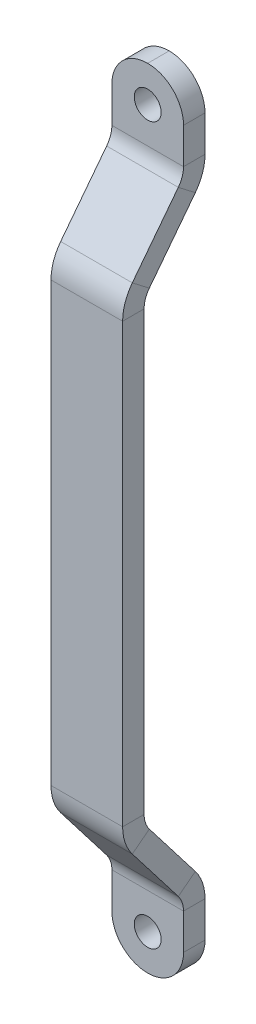
ISO-10303-21;
HEADER;
FILE_DESCRIPTION(('STEP AP214'),'2;1');
FILE_NAME('part.step','',(''),(''),'','','');
FILE_SCHEMA(('AUTOMOTIVE_DESIGN { 1 0 10303 214 1 1 1 1 }'));
ENDSEC;
DATA;
#1=APPLICATION_CONTEXT('core data for automotive mechanical design processes');
#2=APPLICATION_PROTOCOL_DEFINITION('international standard','automotive_design',2000,#1);
#3=PRODUCT_CONTEXT('',#1,'mechanical');
#4=PRODUCT('Part','Part','',(#3));
#5=PRODUCT_RELATED_PRODUCT_CATEGORY('part','',(#4));
#6=PRODUCT_DEFINITION_FORMATION('','',#4);
#7=PRODUCT_DEFINITION_CONTEXT('part definition',#1,'design');
#8=PRODUCT_DEFINITION('design','',#6,#7);
#9=PRODUCT_DEFINITION_SHAPE('','',#8);
#10=(LENGTH_UNIT() NAMED_UNIT(*) SI_UNIT(.MILLI.,.METRE.));
#11=(NAMED_UNIT(*) PLANE_ANGLE_UNIT() SI_UNIT($,.RADIAN.));
#12=(NAMED_UNIT(*) SI_UNIT($,.STERADIAN.) SOLID_ANGLE_UNIT());
#13=UNCERTAINTY_MEASURE_WITH_UNIT(LENGTH_MEASURE(1.E-05),#10,'distance_accuracy_value','');
#14=(GEOMETRIC_REPRESENTATION_CONTEXT(3) GLOBAL_UNCERTAINTY_ASSIGNED_CONTEXT((#13)) GLOBAL_UNIT_ASSIGNED_CONTEXT((#10,
#11,#12)) REPRESENTATION_CONTEXT('',''));
#15=CARTESIAN_POINT('',(0.,0.,0.));
#16=DIRECTION('',(0.,0.,1.));
#17=DIRECTION('',(1.,0.,0.));
#18=AXIS2_PLACEMENT_3D('',#15,#16,#17);
#19=CARTESIAN_POINT('',(0.,0.,0.));
#20=DIRECTION('',(-1.,0.,0.));
#21=DIRECTION('',(0.,0.,1.));
#22=AXIS2_PLACEMENT_3D('',#19,#20,#21);
#23=PLANE('',#22);
#24=DIRECTION('',(0.,1.,0.));
#25=VECTOR('',#24,1.);
#26=CARTESIAN_POINT('',(0.,0.,0.));
#27=LINE('',#26,#25);
#28=CARTESIAN_POINT('',(0.,5.,0.));
#29=VERTEX_POINT('',#28);
#30=CARTESIAN_POINT('',(0.,10.,0.));
#31=VERTEX_POINT('',#30);
#32=EDGE_CURVE('E302',#29,#31,#27,.T.);
#33=ORIENTED_EDGE('',*,*,#32,.F.);
#34=DIRECTION('',(0.,0.,1.));
#35=VECTOR('',#34,1.);
#36=CARTESIAN_POINT('',(0.,5.,3.));
#37=LINE('',#36,#35);
#38=CARTESIAN_POINT('',(0.,5.,3.));
#39=VERTEX_POINT('',#38);
#40=EDGE_CURVE('E414',#29,#39,#37,.T.);
#41=ORIENTED_EDGE('',*,*,#40,.T.);
#42=DIRECTION('',(0.,1.,0.));
#43=VECTOR('',#42,1.);
#44=CARTESIAN_POINT('',(0.,0.,3.));
#45=LINE('',#44,#43);
#46=CARTESIAN_POINT('',(0.,10.,3.));
#47=VERTEX_POINT('',#46);
#48=EDGE_CURVE('E306',#39,#47,#45,.T.);
#49=ORIENTED_EDGE('',*,*,#48,.T.);
#50=DIRECTION('',(0.,0.,1.));
#51=VECTOR('',#50,1.);
#52=CARTESIAN_POINT('',(0.,10.,0.));
#53=LINE('',#52,#51);
#54=EDGE_CURVE('E303',#31,#47,#53,.T.);
#55=ORIENTED_EDGE('',*,*,#54,.F.);
#56=EDGE_LOOP('',(#33,#41,#49,#55));
#57=FACE_BOUND('',#56,.T.);
#58=ADVANCED_FACE('F37',(#57),#23,.T.);
#59=CARTESIAN_POINT('',(0.,0.,3.));
#60=DIRECTION('',(0.,0.,1.));
#61=DIRECTION('',(1.,0.,0.));
#62=AXIS2_PLACEMENT_3D('',#59,#60,#61);
#63=PLANE('',#62);
#64=CARTESIAN_POINT('',(5.,5.,3.));
#65=DIRECTION('',(0.,0.,1.));
#66=DIRECTION('',(1.,0.,0.));
#67=AXIS2_PLACEMENT_3D('',#64,#65,#66);
#68=CIRCLE('',#67,1.875);
#69=CARTESIAN_POINT('',(6.875,5.,3.));
#70=VERTEX_POINT('',#69);
#71=EDGE_CURVE('E198',#70,#70,#68,.T.);
#72=ORIENTED_EDGE('',*,*,#71,.F.);
#73=EDGE_LOOP('',(#72));
#74=FACE_BOUND('',#73,.T.);
#75=ORIENTED_EDGE('',*,*,#48,.F.);
#76=CARTESIAN_POINT('',(5.,5.,3.));
#77=DIRECTION('',(0.,0.,1.));
#78=DIRECTION('',(1.,0.,0.));
#79=AXIS2_PLACEMENT_3D('',#76,#77,#78);
#80=CIRCLE('',#79,5.);
#81=CARTESIAN_POINT('',(5.,0.,3.));
#82=VERTEX_POINT('',#81);
#83=EDGE_CURVE('E419',#39,#82,#80,.T.);
#84=ORIENTED_EDGE('',*,*,#83,.T.);
#85=CARTESIAN_POINT('',(5.,5.,3.));
#86=DIRECTION('',(0.,0.,1.));
#87=DIRECTION('',(1.,0.,0.));
#88=AXIS2_PLACEMENT_3D('',#85,#86,#87);
#89=CIRCLE('',#88,5.);
#90=CARTESIAN_POINT('',(10.,5.,3.));
#91=VERTEX_POINT('',#90);
#92=EDGE_CURVE('E417',#82,#91,#89,.T.);
#93=ORIENTED_EDGE('',*,*,#92,.T.);
#94=DIRECTION('',(0.,1.,0.));
#95=VECTOR('',#94,1.);
#96=CARTESIAN_POINT('',(10.,0.,3.));
#97=LINE('',#96,#95);
#98=CARTESIAN_POINT('',(10.,10.,3.));
#99=VERTEX_POINT('',#98);
#100=EDGE_CURVE('E351',#91,#99,#97,.T.);
#101=ORIENTED_EDGE('',*,*,#100,.T.);
#102=DIRECTION('',(1.,0.,0.));
#103=VECTOR('',#102,1.);
#104=CARTESIAN_POINT('',(0.,10.,3.));
#105=LINE('',#104,#103);
#106=EDGE_CURVE('E308',#47,#99,#105,.T.);
#107=ORIENTED_EDGE('',*,*,#106,.F.);
#108=EDGE_LOOP('',(#75,#84,#93,#101,#107));
#109=FACE_BOUND('',#108,.T.);
#110=ADVANCED_FACE('F440',(#74,#109),#63,.T.);
#111=CARTESIAN_POINT('',(10.,0.,0.));
#112=DIRECTION('',(1.,0.,0.));
#113=DIRECTION('',(0.,0.,-1.));
#114=AXIS2_PLACEMENT_3D('',#111,#112,#113);
#115=PLANE('',#114);
#116=ORIENTED_EDGE('',*,*,#100,.F.);
#117=DIRECTION('',(0.,0.,-1.));
#118=VECTOR('',#117,1.);
#119=CARTESIAN_POINT('',(10.,5.,0.));
#120=LINE('',#119,#118);
#121=CARTESIAN_POINT('',(10.,5.,0.));
#122=VERTEX_POINT('',#121);
#123=EDGE_CURVE('E11',#91,#122,#120,.T.);
#124=ORIENTED_EDGE('',*,*,#123,.T.);
#125=DIRECTION('',(0.,1.,0.));
#126=VECTOR('',#125,1.);
#127=CARTESIAN_POINT('',(10.,0.,0.));
#128=LINE('',#127,#126);
#129=CARTESIAN_POINT('',(10.,10.,0.));
#130=VERTEX_POINT('',#129);
#131=EDGE_CURVE('E376',#122,#130,#128,.T.);
#132=ORIENTED_EDGE('',*,*,#131,.T.);
#133=DIRECTION('',(0.,0.,-1.));
#134=VECTOR('',#133,1.);
#135=CARTESIAN_POINT('',(10.,10.,0.));
#136=LINE('',#135,#134);
#137=EDGE_CURVE('E353',#99,#130,#136,.T.);
#138=ORIENTED_EDGE('',*,*,#137,.F.);
#139=EDGE_LOOP('',(#116,#124,#132,#138));
#140=FACE_BOUND('',#139,.T.);
#141=ADVANCED_FACE('F444',(#140),#115,.T.);
#142=CARTESIAN_POINT('',(0.,0.,0.));
#143=DIRECTION('',(0.,0.,-1.));
#144=DIRECTION('',(-1.,0.,0.));
#145=AXIS2_PLACEMENT_3D('',#142,#143,#144);
#146=PLANE('',#145);
#147=CARTESIAN_POINT('',(5.,5.,0.));
#148=DIRECTION('',(0.,0.,-1.));
#149=DIRECTION('',(-1.,0.,0.));
#150=AXIS2_PLACEMENT_3D('',#147,#148,#149);
#151=CIRCLE('',#150,1.875);
#152=CARTESIAN_POINT('',(3.125,5.,0.));
#153=VERTEX_POINT('',#152);
#154=EDGE_CURVE('E424',#153,#153,#151,.T.);
#155=ORIENTED_EDGE('',*,*,#154,.F.);
#156=EDGE_LOOP('',(#155));
#157=FACE_BOUND('',#156,.T.);
#158=CARTESIAN_POINT('',(5.,5.,0.));
#159=DIRECTION('',(0.,0.,-1.));
#160=DIRECTION('',(-1.,0.,0.));
#161=AXIS2_PLACEMENT_3D('',#158,#159,#160);
#162=CIRCLE('',#161,5.);
#163=CARTESIAN_POINT('',(5.,0.,0.));
#164=VERTEX_POINT('',#163);
#165=EDGE_CURVE('E54',#122,#164,#162,.T.);
#166=ORIENTED_EDGE('',*,*,#165,.T.);
#167=CARTESIAN_POINT('',(5.,5.,0.));
#168=DIRECTION('',(0.,0.,-1.));
#169=DIRECTION('',(-1.,0.,0.));
#170=AXIS2_PLACEMENT_3D('',#167,#168,#169);
#171=CIRCLE('',#170,5.);
#172=EDGE_CURVE('E46',#164,#29,#171,.T.);
#173=ORIENTED_EDGE('',*,*,#172,.T.);
#174=ORIENTED_EDGE('',*,*,#32,.T.);
#175=DIRECTION('',(-1.,0.,0.));
#176=VECTOR('',#175,1.);
#177=CARTESIAN_POINT('',(0.,10.,0.));
#178=LINE('',#177,#176);
#179=EDGE_CURVE('E320',#130,#31,#178,.T.);
#180=ORIENTED_EDGE('',*,*,#179,.F.);
#181=ORIENTED_EDGE('',*,*,#131,.F.);
#182=EDGE_LOOP('',(#166,#173,#174,#180,#181));
#183=FACE_BOUND('',#182,.T.);
#184=ADVANCED_FACE('F459',(#157,#183),#146,.T.);
#185=CARTESIAN_POINT('',(0.,10.,0.));
#186=DIRECTION('',(-1.,0.,0.));
#187=DIRECTION('',(0.,0.,1.));
#188=AXIS2_PLACEMENT_3D('',#185,#186,#187);
#189=PLANE('',#188);
#190=CARTESIAN_POINT('',(0.,10.,6.5));
#191=DIRECTION('',(1.,0.,0.));
#192=DIRECTION('',(0.,0.,-1.));
#193=AXIS2_PLACEMENT_3D('',#190,#191,#192);
#194=CIRCLE('',#193,3.5);
#195=CARTESIAN_POINT('',(0.,12.1361264202435,3.72746254908296));
#196=VERTEX_POINT('',#195);
#197=EDGE_CURVE('E313',#47,#196,#194,.T.);
#198=ORIENTED_EDGE('',*,*,#197,.T.);
#199=DIRECTION('',(0.,-0.610321834355294,0.792153557404869));
#200=VECTOR('',#199,1.);
#201=CARTESIAN_POINT('',(0.,13.9670919233094,1.35100187686835));
#202=LINE('',#201,#200);
#203=CARTESIAN_POINT('',(0.,13.9670919233094,1.35100187686835));
#204=VERTEX_POINT('',#203);
#205=EDGE_CURVE('E310',#204,#196,#202,.T.);
#206=ORIENTED_EDGE('',*,*,#205,.F.);
#207=CARTESIAN_POINT('',(0.,10.,6.5));
#208=DIRECTION('',(1.,0.,0.));
#209=DIRECTION('',(0.,0.,-1.));
#210=AXIS2_PLACEMENT_3D('',#207,#208,#209);
#211=CIRCLE('',#210,6.5);
#212=EDGE_CURVE('E314',#31,#204,#211,.T.);
#213=ORIENTED_EDGE('',*,*,#212,.F.);
#214=ORIENTED_EDGE('',*,*,#54,.T.);
#215=EDGE_LOOP('',(#198,#206,#213,#214));
#216=FACE_BOUND('',#215,.T.);
#217=ADVANCED_FACE('F454',(#216),#189,.T.);
#218=CARTESIAN_POINT('',(0.,10.,6.5));
#219=DIRECTION('',(1.,0.,0.));
#220=DIRECTION('',(0.,0.,-1.));
#221=AXIS2_PLACEMENT_3D('',#218,#219,#220);
#222=CYLINDRICAL_SURFACE('',#221,3.5);
#223=CARTESIAN_POINT('',(10.,10.,6.5));
#224=DIRECTION('',(1.,0.,0.));
#225=DIRECTION('',(0.,0.,-1.));
#226=AXIS2_PLACEMENT_3D('',#223,#224,#225);
#227=CIRCLE('',#226,3.5);
#228=CARTESIAN_POINT('',(10.,12.1361264202435,3.72746254908296));
#229=VERTEX_POINT('',#228);
#230=EDGE_CURVE('E356',#99,#229,#227,.T.);
#231=ORIENTED_EDGE('',*,*,#230,.T.);
#232=DIRECTION('',(1.,0.,0.));
#233=VECTOR('',#232,1.);
#234=CARTESIAN_POINT('',(0.,12.1361264202435,3.72746254908296));
#235=LINE('',#234,#233);
#236=EDGE_CURVE('E317',#196,#229,#235,.T.);
#237=ORIENTED_EDGE('',*,*,#236,.F.);
#238=ORIENTED_EDGE('',*,*,#197,.F.);
#239=ORIENTED_EDGE('',*,*,#106,.T.);
#240=EDGE_LOOP('',(#231,#237,#238,#239));
#241=FACE_BOUND('',#240,.T.);
#242=ADVANCED_FACE('F449',(#241),#222,.F.);
#243=CARTESIAN_POINT('',(10.,10.,0.));
#244=DIRECTION('',(1.,0.,0.));
#245=DIRECTION('',(0.,0.,-1.));
#246=AXIS2_PLACEMENT_3D('',#243,#244,#245);
#247=PLANE('',#246);
#248=CARTESIAN_POINT('',(10.,10.,6.5));
#249=DIRECTION('',(1.,0.,0.));
#250=DIRECTION('',(0.,0.,-1.));
#251=AXIS2_PLACEMENT_3D('',#248,#249,#250);
#252=CIRCLE('',#251,6.5);
#253=CARTESIAN_POINT('',(10.,13.9670919233094,1.35100187686835));
#254=VERTEX_POINT('',#253);
#255=EDGE_CURVE('E380',#130,#254,#252,.T.);
#256=ORIENTED_EDGE('',*,*,#255,.T.);
#257=DIRECTION('',(0.,0.610321834355294,-0.792153557404869));
#258=VECTOR('',#257,1.);
#259=CARTESIAN_POINT('',(10.,13.9670919233094,1.35100187686835));
#260=LINE('',#259,#258);
#261=EDGE_CURVE('E359',#229,#254,#260,.T.);
#262=ORIENTED_EDGE('',*,*,#261,.F.);
#263=ORIENTED_EDGE('',*,*,#230,.F.);
#264=ORIENTED_EDGE('',*,*,#137,.T.);
#265=EDGE_LOOP('',(#256,#262,#263,#264));
#266=FACE_BOUND('',#265,.T.);
#267=ADVANCED_FACE('F464',(#266),#247,.T.);
#268=CARTESIAN_POINT('',(0.,10.,6.5));
#269=DIRECTION('',(1.,0.,0.));
#270=DIRECTION('',(0.,0.,-1.));
#271=AXIS2_PLACEMENT_3D('',#268,#269,#270);
#272=CYLINDRICAL_SURFACE('',#271,6.5);
#273=DIRECTION('',(-1.,0.,0.));
#274=VECTOR('',#273,1.);
#275=CARTESIAN_POINT('',(0.,13.9670919233094,1.35100187686835));
#276=LINE('',#275,#274);
#277=EDGE_CURVE('E331',#254,#204,#276,.T.);
#278=ORIENTED_EDGE('',*,*,#277,.F.);
#279=ORIENTED_EDGE('',*,*,#255,.F.);
#280=ORIENTED_EDGE('',*,*,#179,.T.);
#281=ORIENTED_EDGE('',*,*,#212,.T.);
#282=EDGE_LOOP('',(#278,#279,#280,#281));
#283=FACE_BOUND('',#282,.T.);
#284=ADVANCED_FACE('F462',(#283),#272,.T.);
#285=CARTESIAN_POINT('',(0.,13.9670919233094,1.35100187686835));
#286=DIRECTION('',(-1.,0.,0.));
#287=DIRECTION('',(0.,0.,1.));
#288=AXIS2_PLACEMENT_3D('',#285,#286,#287);
#289=PLANE('',#288);
#290=DIRECTION('',(0.,0.792153557404869,0.610321834355294));
#291=VECTOR('',#290,1.);
#292=CARTESIAN_POINT('',(0.,12.1361264202435,3.72746254908296));
#293=LINE('',#292,#291);
#294=CARTESIAN_POINT('',(0.,20.4708147152445,10.1489981231317));
#295=VERTEX_POINT('',#294);
#296=EDGE_CURVE('E324',#196,#295,#293,.T.);
#297=ORIENTED_EDGE('',*,*,#296,.T.);
#298=DIRECTION('',(0.,-0.610321834355294,0.792153557404869));
#299=VECTOR('',#298,1.);
#300=CARTESIAN_POINT('',(0.,22.3017802183104,7.77253745091705));
#301=LINE('',#300,#299);
#302=CARTESIAN_POINT('',(0.,22.3017802183104,7.77253745091705));
#303=VERTEX_POINT('',#302);
#304=EDGE_CURVE('E321',#303,#295,#301,.T.);
#305=ORIENTED_EDGE('',*,*,#304,.F.);
#306=DIRECTION('',(0.,0.792153557404869,0.610321834355294));
#307=VECTOR('',#306,1.);
#308=CARTESIAN_POINT('',(0.,13.9670919233094,1.35100187686835));
#309=LINE('',#308,#307);
#310=EDGE_CURVE('E325',#204,#303,#309,.T.);
#311=ORIENTED_EDGE('',*,*,#310,.F.);
#312=ORIENTED_EDGE('',*,*,#205,.T.);
#313=EDGE_LOOP('',(#297,#305,#311,#312));
#314=FACE_BOUND('',#313,.T.);
#315=ADVANCED_FACE('F549',(#314),#289,.T.);
#316=CARTESIAN_POINT('',(0.,12.1361264202435,3.72746254908296));
#317=DIRECTION('',(0.,-0.610321834355294,0.792153557404869));
#318=DIRECTION('',(0.,-0.792153557404869,-0.610321834355294));
#319=AXIS2_PLACEMENT_3D('',#316,#317,#318);
#320=PLANE('',#319);
#321=DIRECTION('',(0.,0.792153557404869,0.610321834355294));
#322=VECTOR('',#321,1.);
#323=CARTESIAN_POINT('',(10.,12.1361264202435,3.72746254908296));
#324=LINE('',#323,#322);
#325=CARTESIAN_POINT('',(10.,20.4708147152445,10.1489981231317));
#326=VERTEX_POINT('',#325);
#327=EDGE_CURVE('E362',#229,#326,#324,.T.);
#328=ORIENTED_EDGE('',*,*,#327,.T.);
#329=DIRECTION('',(1.,0.,0.));
#330=VECTOR('',#329,1.);
#331=CARTESIAN_POINT('',(0.,20.4708147152445,10.1489981231317));
#332=LINE('',#331,#330);
#333=EDGE_CURVE('E328',#295,#326,#332,.T.);
#334=ORIENTED_EDGE('',*,*,#333,.F.);
#335=ORIENTED_EDGE('',*,*,#296,.F.);
#336=ORIENTED_EDGE('',*,*,#236,.T.);
#337=EDGE_LOOP('',(#328,#334,#335,#336));
#338=FACE_BOUND('',#337,.T.);
#339=ADVANCED_FACE('F470',(#338),#320,.T.);
#340=CARTESIAN_POINT('',(10.,13.9670919233094,1.35100187686835));
#341=DIRECTION('',(1.,0.,0.));
#342=DIRECTION('',(0.,0.,-1.));
#343=AXIS2_PLACEMENT_3D('',#340,#341,#342);
#344=PLANE('',#343);
#345=DIRECTION('',(0.,0.792153557404869,0.610321834355294));
#346=VECTOR('',#345,1.);
#347=CARTESIAN_POINT('',(10.,13.9670919233094,1.35100187686835));
#348=LINE('',#347,#346);
#349=CARTESIAN_POINT('',(10.,22.3017802183104,7.77253745091705));
#350=VERTEX_POINT('',#349);
#351=EDGE_CURVE('E385',#254,#350,#348,.T.);
#352=ORIENTED_EDGE('',*,*,#351,.T.);
#353=DIRECTION('',(0.,0.610321834355294,-0.792153557404869));
#354=VECTOR('',#353,1.);
#355=CARTESIAN_POINT('',(10.,22.3017802183104,7.77253745091705));
#356=LINE('',#355,#354);
#357=EDGE_CURVE('E365',#326,#350,#356,.T.);
#358=ORIENTED_EDGE('',*,*,#357,.F.);
#359=ORIENTED_EDGE('',*,*,#327,.F.);
#360=ORIENTED_EDGE('',*,*,#261,.T.);
#361=EDGE_LOOP('',(#352,#358,#359,#360));
#362=FACE_BOUND('',#361,.T.);
#363=ADVANCED_FACE('F466',(#362),#344,.T.);
#364=CARTESIAN_POINT('',(0.,13.9670919233094,1.35100187686835));
#365=DIRECTION('',(0.,0.610321834355294,-0.792153557404869));
#366=DIRECTION('',(0.,0.792153557404869,0.610321834355294));
#367=AXIS2_PLACEMENT_3D('',#364,#365,#366);
#368=PLANE('',#367);
#369=DIRECTION('',(-1.,0.,0.));
#370=VECTOR('',#369,1.);
#371=CARTESIAN_POINT('',(0.,22.3017802183104,7.77253745091705));
#372=LINE('',#371,#370);
#373=EDGE_CURVE('E342',#350,#303,#372,.T.);
#374=ORIENTED_EDGE('',*,*,#373,.F.);
#375=ORIENTED_EDGE('',*,*,#351,.F.);
#376=ORIENTED_EDGE('',*,*,#277,.T.);
#377=ORIENTED_EDGE('',*,*,#310,.T.);
#378=EDGE_LOOP('',(#374,#375,#376,#377));
#379=FACE_BOUND('',#378,.T.);
#380=ADVANCED_FACE('F543',(#379),#368,.T.);
#381=CARTESIAN_POINT('',(0.,22.3017802183104,7.77253745091705));
#382=DIRECTION('',(-1.,0.,0.));
#383=DIRECTION('',(0.,0.,1.));
#384=AXIS2_PLACEMENT_3D('',#381,#382,#383);
#385=PLANE('',#384);
#386=CARTESIAN_POINT('',(0.,24.4379066385539,5.));
#387=DIRECTION('',(-1.,0.,0.));
#388=DIRECTION('',(0.,-0.610321834355294,0.792153557404869));
#389=AXIS2_PLACEMENT_3D('',#386,#387,#388);
#390=CIRCLE('',#389,6.5);
#391=CARTESIAN_POINT('',(0.,24.4379066385539,11.5));
#392=VERTEX_POINT('',#391);
#393=EDGE_CURVE('E335',#295,#392,#390,.T.);
#394=ORIENTED_EDGE('',*,*,#393,.T.);
#395=DIRECTION('',(0.,0.,1.));
#396=VECTOR('',#395,1.);
#397=CARTESIAN_POINT('',(0.,24.4379066385539,8.5));
#398=LINE('',#397,#396);
#399=CARTESIAN_POINT('',(0.,24.4379066385539,8.5));
#400=VERTEX_POINT('',#399);
#401=EDGE_CURVE('E332',#400,#392,#398,.T.);
#402=ORIENTED_EDGE('',*,*,#401,.F.);
#403=CARTESIAN_POINT('',(0.,24.4379066385539,5.));
#404=DIRECTION('',(-1.,0.,0.));
#405=DIRECTION('',(0.,-0.610321834355294,0.792153557404869));
#406=AXIS2_PLACEMENT_3D('',#403,#404,#405);
#407=CIRCLE('',#406,3.5);
#408=EDGE_CURVE('E336',#303,#400,#407,.T.);
#409=ORIENTED_EDGE('',*,*,#408,.F.);
#410=ORIENTED_EDGE('',*,*,#304,.T.);
#411=EDGE_LOOP('',(#394,#402,#409,#410));
#412=FACE_BOUND('',#411,.T.);
#413=ADVANCED_FACE('F476',(#412),#385,.T.);
#414=CARTESIAN_POINT('',(0.,24.4379066385539,5.));
#415=DIRECTION('',(-1.,0.,0.));
#416=DIRECTION('',(0.,0.,1.));
#417=AXIS2_PLACEMENT_3D('',#414,#415,#416);
#418=CYLINDRICAL_SURFACE('',#417,6.5);
#419=CARTESIAN_POINT('',(10.,24.4379066385539,5.));
#420=DIRECTION('',(-1.,0.,0.));
#421=DIRECTION('',(0.,-0.610321834355294,0.792153557404869));
#422=AXIS2_PLACEMENT_3D('',#419,#420,#421);
#423=CIRCLE('',#422,6.5);
#424=CARTESIAN_POINT('',(10.,24.4379066385539,11.5));
#425=VERTEX_POINT('',#424);
#426=EDGE_CURVE('E368',#326,#425,#423,.T.);
#427=ORIENTED_EDGE('',*,*,#426,.T.);
#428=DIRECTION('',(1.,0.,0.));
#429=VECTOR('',#428,1.);
#430=CARTESIAN_POINT('',(0.,24.4379066385539,11.5));
#431=LINE('',#430,#429);
#432=EDGE_CURVE('E339',#392,#425,#431,.T.);
#433=ORIENTED_EDGE('',*,*,#432,.F.);
#434=ORIENTED_EDGE('',*,*,#393,.F.);
#435=ORIENTED_EDGE('',*,*,#333,.T.);
#436=EDGE_LOOP('',(#427,#433,#434,#435));
#437=FACE_BOUND('',#436,.T.);
#438=ADVANCED_FACE('F472',(#437),#418,.T.);
#439=CARTESIAN_POINT('',(10.,22.3017802183104,7.77253745091705));
#440=DIRECTION('',(1.,0.,0.));
#441=DIRECTION('',(0.,0.,-1.));
#442=AXIS2_PLACEMENT_3D('',#439,#440,#441);
#443=PLANE('',#442);
#444=CARTESIAN_POINT('',(10.,24.4379066385539,5.));
#445=DIRECTION('',(-1.,0.,0.));
#446=DIRECTION('',(0.,-0.610321834355294,0.792153557404869));
#447=AXIS2_PLACEMENT_3D('',#444,#445,#446);
#448=CIRCLE('',#447,3.5);
#449=CARTESIAN_POINT('',(10.,24.4379066385539,8.5));
#450=VERTEX_POINT('',#449);
#451=EDGE_CURVE('E390',#350,#450,#448,.T.);
#452=ORIENTED_EDGE('',*,*,#451,.T.);
#453=DIRECTION('',(0.,0.,-1.));
#454=VECTOR('',#453,1.);
#455=CARTESIAN_POINT('',(10.,24.4379066385539,8.5));
#456=LINE('',#455,#454);
#457=EDGE_CURVE('E371',#425,#450,#456,.T.);
#458=ORIENTED_EDGE('',*,*,#457,.F.);
#459=ORIENTED_EDGE('',*,*,#426,.F.);
#460=ORIENTED_EDGE('',*,*,#357,.T.);
#461=EDGE_LOOP('',(#452,#458,#459,#460));
#462=FACE_BOUND('',#461,.T.);
#463=ADVANCED_FACE('F491',(#462),#443,.T.);
#464=CARTESIAN_POINT('',(0.,24.4379066385539,5.));
#465=DIRECTION('',(-1.,0.,0.));
#466=DIRECTION('',(0.,0.,1.));
#467=AXIS2_PLACEMENT_3D('',#464,#465,#466);
#468=CYLINDRICAL_SURFACE('',#467,3.5);
#469=DIRECTION('',(-1.,0.,0.));
#470=VECTOR('',#469,1.);
#471=CARTESIAN_POINT('',(0.,24.4379066385539,8.5));
#472=LINE('',#471,#470);
#473=EDGE_CURVE('E348',#450,#400,#472,.T.);
#474=ORIENTED_EDGE('',*,*,#473,.F.);
#475=ORIENTED_EDGE('',*,*,#451,.F.);
#476=ORIENTED_EDGE('',*,*,#373,.T.);
#477=ORIENTED_EDGE('',*,*,#408,.T.);
#478=EDGE_LOOP('',(#474,#475,#476,#477));
#479=FACE_BOUND('',#478,.T.);
#480=ADVANCED_FACE('F487',(#479),#468,.F.);
#481=CARTESIAN_POINT('',(0.,24.4379066385539,8.5));
#482=DIRECTION('',(-1.,0.,0.));
#483=DIRECTION('',(0.,0.,1.));
#484=AXIS2_PLACEMENT_3D('',#481,#482,#483);
#485=PLANE('',#484);
#486=DIRECTION('',(0.,1.,0.));
#487=VECTOR('',#486,1.);
#488=CARTESIAN_POINT('',(0.,24.4379066385539,11.5));
#489=LINE('',#488,#487);
#490=CARTESIAN_POINT('',(0.,85.5620933614461,11.5));
#491=VERTEX_POINT('',#490);
#492=EDGE_CURVE('E343',#392,#491,#489,.T.);
#493=ORIENTED_EDGE('',*,*,#492,.T.);
#494=DIRECTION('',(0.,0.,1.));
#495=VECTOR('',#494,1.);
#496=CARTESIAN_POINT('',(0.,85.5620933614461,8.5));
#497=LINE('',#496,#495);
#498=CARTESIAN_POINT('',(0.,85.5620933614461,8.5));
#499=VERTEX_POINT('',#498);
#500=EDGE_CURVE('E246',#499,#491,#497,.T.);
#501=ORIENTED_EDGE('',*,*,#500,.F.);
#502=DIRECTION('',(0.,1.,0.));
#503=VECTOR('',#502,1.);
#504=CARTESIAN_POINT('',(0.,24.4379066385539,8.5));
#505=LINE('',#504,#503);
#506=EDGE_CURVE('E346',#400,#499,#505,.T.);
#507=ORIENTED_EDGE('',*,*,#506,.F.);
#508=ORIENTED_EDGE('',*,*,#401,.T.);
#509=EDGE_LOOP('',(#493,#501,#507,#508));
#510=FACE_BOUND('',#509,.T.);
#511=ADVANCED_FACE('F479',(#510),#485,.T.);
#512=CARTESIAN_POINT('',(0.,24.4379066385539,11.5));
#513=DIRECTION('',(0.,0.,1.));
#514=DIRECTION('',(0.,-1.,0.));
#515=AXIS2_PLACEMENT_3D('',#512,#513,#514);
#516=PLANE('',#515);
#517=DIRECTION('',(0.,1.,0.));
#518=VECTOR('',#517,1.);
#519=CARTESIAN_POINT('',(10.,24.4379066385539,11.5));
#520=LINE('',#519,#518);
#521=CARTESIAN_POINT('',(10.,85.5620933614461,11.5));
#522=VERTEX_POINT('',#521);
#523=EDGE_CURVE('E345',#425,#522,#520,.T.);
#524=ORIENTED_EDGE('',*,*,#523,.T.);
#525=DIRECTION('',(1.,0.,0.));
#526=VECTOR('',#525,1.);
#527=CARTESIAN_POINT('',(0.,85.5620933614461,11.5));
#528=LINE('',#527,#526);
#529=EDGE_CURVE('E253',#491,#522,#528,.T.);
#530=ORIENTED_EDGE('',*,*,#529,.F.);
#531=ORIENTED_EDGE('',*,*,#492,.F.);
#532=ORIENTED_EDGE('',*,*,#432,.T.);
#533=EDGE_LOOP('',(#524,#530,#531,#532));
#534=FACE_BOUND('',#533,.T.);
#535=ADVANCED_FACE('F496',(#534),#516,.T.);
#536=CARTESIAN_POINT('',(10.,24.4379066385539,8.5));
#537=DIRECTION('',(1.,0.,0.));
#538=DIRECTION('',(0.,0.,-1.));
#539=AXIS2_PLACEMENT_3D('',#536,#537,#538);
#540=PLANE('',#539);
#541=DIRECTION('',(0.,1.,0.));
#542=VECTOR('',#541,1.);
#543=CARTESIAN_POINT('',(10.,24.4379066385539,8.5));
#544=LINE('',#543,#542);
#545=CARTESIAN_POINT('',(10.,85.5620933614461,8.5));
#546=VERTEX_POINT('',#545);
#547=EDGE_CURVE('E373',#450,#546,#544,.T.);
#548=ORIENTED_EDGE('',*,*,#547,.T.);
#549=DIRECTION('',(0.,0.,-1.));
#550=VECTOR('',#549,1.);
#551=CARTESIAN_POINT('',(10.,85.5620933614461,8.5));
#552=LINE('',#551,#550);
#553=EDGE_CURVE('E279',#522,#546,#552,.T.);
#554=ORIENTED_EDGE('',*,*,#553,.F.);
#555=ORIENTED_EDGE('',*,*,#523,.F.);
#556=ORIENTED_EDGE('',*,*,#457,.T.);
#557=EDGE_LOOP('',(#548,#554,#555,#556));
#558=FACE_BOUND('',#557,.T.);
#559=ADVANCED_FACE('F493',(#558),#540,.T.);
#560=CARTESIAN_POINT('',(0.,24.4379066385539,8.5));
#561=DIRECTION('',(0.,0.,-1.));
#562=DIRECTION('',(0.,1.,0.));
#563=AXIS2_PLACEMENT_3D('',#560,#561,#562);
#564=PLANE('',#563);
#565=ORIENTED_EDGE('',*,*,#506,.T.);
#566=DIRECTION('',(-1.,0.,0.));
#567=VECTOR('',#566,1.);
#568=CARTESIAN_POINT('',(0.,85.5620933614461,8.5));
#569=LINE('',#568,#567);
#570=EDGE_CURVE('E295',#546,#499,#569,.T.);
#571=ORIENTED_EDGE('',*,*,#570,.F.);
#572=ORIENTED_EDGE('',*,*,#547,.F.);
#573=ORIENTED_EDGE('',*,*,#473,.T.);
#574=EDGE_LOOP('',(#565,#571,#572,#573));
#575=FACE_BOUND('',#574,.T.);
#576=ADVANCED_FACE('F485',(#575),#564,.T.);
#577=CARTESIAN_POINT('',(0.,110.,0.));
#578=DIRECTION('',(-1.,0.,0.));
#579=DIRECTION('',(0.,0.,1.));
#580=AXIS2_PLACEMENT_3D('',#577,#578,#579);
#581=PLANE('',#580);
#582=DIRECTION('',(0.,-1.,0.));
#583=VECTOR('',#582,1.);
#584=CARTESIAN_POINT('',(0.,110.,3.));
#585=LINE('',#584,#583);
#586=CARTESIAN_POINT('',(0.,105.,3.));
#587=VERTEX_POINT('',#586);
#588=CARTESIAN_POINT('',(0.,100.,3.));
#589=VERTEX_POINT('',#588);
#590=EDGE_CURVE('E226',#587,#589,#585,.T.);
#591=ORIENTED_EDGE('',*,*,#590,.F.);
#592=DIRECTION('',(0.,0.,1.));
#593=VECTOR('',#592,1.);
#594=CARTESIAN_POINT('',(0.,105.,0.));
#595=LINE('',#594,#593);
#596=CARTESIAN_POINT('',(0.,105.,0.));
#597=VERTEX_POINT('',#596);
#598=EDGE_CURVE('E194',#587,#597,#595,.F.);
#599=ORIENTED_EDGE('',*,*,#598,.T.);
#600=DIRECTION('',(0.,-1.,0.));
#601=VECTOR('',#600,1.);
#602=CARTESIAN_POINT('',(0.,110.,0.));
#603=LINE('',#602,#601);
#604=CARTESIAN_POINT('',(0.,100.,0.));
#605=VERTEX_POINT('',#604);
#606=EDGE_CURVE('E187',#597,#605,#603,.T.);
#607=ORIENTED_EDGE('',*,*,#606,.T.);
#608=DIRECTION('',(0.,0.,1.));
#609=VECTOR('',#608,1.);
#610=CARTESIAN_POINT('',(0.,100.,0.));
#611=LINE('',#610,#609);
#612=EDGE_CURVE('E192',#605,#589,#611,.T.);
#613=ORIENTED_EDGE('',*,*,#612,.T.);
#614=EDGE_LOOP('',(#591,#599,#607,#613));
#615=FACE_BOUND('',#614,.T.);
#616=ADVANCED_FACE('F190',(#615),#581,.T.);
#617=CARTESIAN_POINT('',(0.,110.,3.));
#618=DIRECTION('',(0.,0.,1.));
#619=DIRECTION('',(1.,0.,0.));
#620=AXIS2_PLACEMENT_3D('',#617,#618,#619);
#621=PLANE('',#620);
#622=CARTESIAN_POINT('',(5.,105.,3.));
#623=DIRECTION('',(0.,0.,1.));
#624=DIRECTION('',(1.,0.,0.));
#625=AXIS2_PLACEMENT_3D('',#622,#623,#624);
#626=CIRCLE('',#625,1.875);
#627=CARTESIAN_POINT('',(6.875,105.,3.));
#628=VERTEX_POINT('',#627);
#629=EDGE_CURVE('E636',#628,#628,#626,.T.);
#630=ORIENTED_EDGE('',*,*,#629,.F.);
#631=EDGE_LOOP('',(#630));
#632=FACE_BOUND('',#631,.T.);
#633=DIRECTION('',(0.,-1.,0.));
#634=VECTOR('',#633,1.);
#635=CARTESIAN_POINT('',(10.,110.,3.));
#636=LINE('',#635,#634);
#637=CARTESIAN_POINT('',(10.,105.,3.));
#638=VERTEX_POINT('',#637);
#639=CARTESIAN_POINT('',(10.,100.,3.));
#640=VERTEX_POINT('',#639);
#641=EDGE_CURVE('E259',#638,#640,#636,.T.);
#642=ORIENTED_EDGE('',*,*,#641,.F.);
#643=CARTESIAN_POINT('',(5.,105.,3.));
#644=DIRECTION('',(0.,0.,1.));
#645=DIRECTION('',(1.,0.,0.));
#646=AXIS2_PLACEMENT_3D('',#643,#644,#645);
#647=CIRCLE('',#646,5.);
#648=CARTESIAN_POINT('',(5.,110.,3.));
#649=VERTEX_POINT('',#648);
#650=EDGE_CURVE('E411',#638,#649,#647,.T.);
#651=ORIENTED_EDGE('',*,*,#650,.T.);
#652=CARTESIAN_POINT('',(5.,105.,3.));
#653=DIRECTION('',(0.,0.,1.));
#654=DIRECTION('',(1.,0.,0.));
#655=AXIS2_PLACEMENT_3D('',#652,#653,#654);
#656=CIRCLE('',#655,5.);
#657=EDGE_CURVE('E409',#649,#587,#656,.T.);
#658=ORIENTED_EDGE('',*,*,#657,.T.);
#659=ORIENTED_EDGE('',*,*,#590,.T.);
#660=DIRECTION('',(1.,0.,0.));
#661=VECTOR('',#660,1.);
#662=CARTESIAN_POINT('',(0.,100.,3.));
#663=LINE('',#662,#661);
#664=EDGE_CURVE('E228',#589,#640,#663,.T.);
#665=ORIENTED_EDGE('',*,*,#664,.T.);
#666=EDGE_LOOP('',(#642,#651,#658,#659,#665));
#667=FACE_BOUND('',#666,.T.);
#668=ADVANCED_FACE('F516',(#632,#667),#621,.T.);
#669=CARTESIAN_POINT('',(10.,110.,0.));
#670=DIRECTION('',(1.,0.,0.));
#671=DIRECTION('',(0.,0.,-1.));
#672=AXIS2_PLACEMENT_3D('',#669,#670,#671);
#673=PLANE('',#672);
#674=DIRECTION('',(0.,-1.,0.));
#675=VECTOR('',#674,1.);
#676=CARTESIAN_POINT('',(10.,110.,0.));
#677=LINE('',#676,#675);
#678=CARTESIAN_POINT('',(10.,105.,0.));
#679=VERTEX_POINT('',#678);
#680=CARTESIAN_POINT('',(10.,100.,0.));
#681=VERTEX_POINT('',#680);
#682=EDGE_CURVE('E218',#679,#681,#677,.T.);
#683=ORIENTED_EDGE('',*,*,#682,.F.);
#684=DIRECTION('',(0.,0.,-1.));
#685=VECTOR('',#684,1.);
#686=CARTESIAN_POINT('',(10.,105.,3.));
#687=LINE('',#686,#685);
#688=EDGE_CURVE('E406',#679,#638,#687,.F.);
#689=ORIENTED_EDGE('',*,*,#688,.T.);
#690=ORIENTED_EDGE('',*,*,#641,.T.);
#691=DIRECTION('',(0.,0.,-1.));
#692=VECTOR('',#691,1.);
#693=CARTESIAN_POINT('',(10.,100.,0.));
#694=LINE('',#693,#692);
#695=EDGE_CURVE('E261',#640,#681,#694,.T.);
#696=ORIENTED_EDGE('',*,*,#695,.T.);
#697=EDGE_LOOP('',(#683,#689,#690,#696));
#698=FACE_BOUND('',#697,.T.);
#699=ADVANCED_FACE('F522',(#698),#673,.T.);
#700=CARTESIAN_POINT('',(0.,110.,0.));
#701=DIRECTION('',(0.,0.,-1.));
#702=DIRECTION('',(-1.,0.,0.));
#703=AXIS2_PLACEMENT_3D('',#700,#701,#702);
#704=PLANE('',#703);
#705=CARTESIAN_POINT('',(5.,105.,0.));
#706=DIRECTION('',(0.,0.,-1.));
#707=DIRECTION('',(-1.,0.,0.));
#708=AXIS2_PLACEMENT_3D('',#705,#706,#707);
#709=CIRCLE('',#708,1.875);
#710=CARTESIAN_POINT('',(3.125,105.,0.));
#711=VERTEX_POINT('',#710);
#712=EDGE_CURVE('E429',#711,#711,#709,.T.);
#713=ORIENTED_EDGE('',*,*,#712,.F.);
#714=EDGE_LOOP('',(#713));
#715=FACE_BOUND('',#714,.T.);
#716=CARTESIAN_POINT('',(5.,105.,0.));
#717=DIRECTION('',(0.,0.,-1.));
#718=DIRECTION('',(-1.,0.,0.));
#719=AXIS2_PLACEMENT_3D('',#716,#717,#718);
#720=CIRCLE('',#719,5.);
#721=CARTESIAN_POINT('',(5.,110.,0.));
#722=VERTEX_POINT('',#721);
#723=EDGE_CURVE('E394',#597,#722,#720,.T.);
#724=ORIENTED_EDGE('',*,*,#723,.T.);
#725=CARTESIAN_POINT('',(5.,105.,0.));
#726=DIRECTION('',(0.,0.,-1.));
#727=DIRECTION('',(-1.,0.,0.));
#728=AXIS2_PLACEMENT_3D('',#725,#726,#727);
#729=CIRCLE('',#728,5.);
#730=EDGE_CURVE('E404',#722,#679,#729,.T.);
#731=ORIENTED_EDGE('',*,*,#730,.T.);
#732=ORIENTED_EDGE('',*,*,#682,.T.);
#733=DIRECTION('',(-1.,0.,0.));
#734=VECTOR('',#733,1.);
#735=CARTESIAN_POINT('',(0.,100.,0.));
#736=LINE('',#735,#734);
#737=EDGE_CURVE('E207',#681,#605,#736,.T.);
#738=ORIENTED_EDGE('',*,*,#737,.T.);
#739=ORIENTED_EDGE('',*,*,#606,.F.);
#740=EDGE_LOOP('',(#724,#731,#732,#738,#739));
#741=FACE_BOUND('',#740,.T.);
#742=ADVANCED_FACE('F216',(#715,#741),#704,.T.);
#743=CARTESIAN_POINT('',(0.,100.,0.));
#744=DIRECTION('',(-1.,0.,0.));
#745=DIRECTION('',(0.,0.,1.));
#746=AXIS2_PLACEMENT_3D('',#743,#744,#745);
#747=PLANE('',#746);
#748=CARTESIAN_POINT('',(0.,100.,6.5));
#749=DIRECTION('',(-1.,0.,0.));
#750=DIRECTION('',(0.,0.,-1.));
#751=AXIS2_PLACEMENT_3D('',#748,#749,#750);
#752=CIRCLE('',#751,3.5);
#753=CARTESIAN_POINT('',(0.,97.8638735797565,3.72746254908296));
#754=VERTEX_POINT('',#753);
#755=EDGE_CURVE('E224',#589,#754,#752,.T.);
#756=ORIENTED_EDGE('',*,*,#755,.F.);
#757=ORIENTED_EDGE('',*,*,#612,.F.);
#758=CARTESIAN_POINT('',(0.,100.,6.5));
#759=DIRECTION('',(-1.,0.,0.));
#760=DIRECTION('',(0.,0.,-1.));
#761=AXIS2_PLACEMENT_3D('',#758,#759,#760);
#762=CIRCLE('',#761,6.5);
#763=CARTESIAN_POINT('',(0.,96.0329080766906,1.35100187686835));
#764=VERTEX_POINT('',#763);
#765=EDGE_CURVE('E204',#605,#764,#762,.T.);
#766=ORIENTED_EDGE('',*,*,#765,.T.);
#767=DIRECTION('',(0.,0.610321834355294,0.792153557404869));
#768=VECTOR('',#767,1.);
#769=CARTESIAN_POINT('',(0.,96.0329080766906,1.35100187686835));
#770=LINE('',#769,#768);
#771=EDGE_CURVE('E214',#764,#754,#770,.T.);
#772=ORIENTED_EDGE('',*,*,#771,.T.);
#773=EDGE_LOOP('',(#756,#757,#766,#772));
#774=FACE_BOUND('',#773,.T.);
#775=ADVANCED_FACE('F222',(#774),#747,.T.);
#776=CARTESIAN_POINT('',(0.,100.,6.5));
#777=DIRECTION('',(1.,0.,0.));
#778=DIRECTION('',(0.,0.,-1.));
#779=AXIS2_PLACEMENT_3D('',#776,#777,#778);
#780=CYLINDRICAL_SURFACE('',#779,3.5);
#781=CARTESIAN_POINT('',(10.,100.,6.5));
#782=DIRECTION('',(-1.,0.,0.));
#783=DIRECTION('',(0.,0.,-1.));
#784=AXIS2_PLACEMENT_3D('',#781,#782,#783);
#785=CIRCLE('',#784,3.5);
#786=CARTESIAN_POINT('',(10.,97.8638735797565,3.72746254908296));
#787=VERTEX_POINT('',#786);
#788=EDGE_CURVE('E264',#640,#787,#785,.T.);
#789=ORIENTED_EDGE('',*,*,#788,.F.);
#790=ORIENTED_EDGE('',*,*,#664,.F.);
#791=ORIENTED_EDGE('',*,*,#755,.T.);
#792=DIRECTION('',(1.,0.,0.));
#793=VECTOR('',#792,1.);
#794=CARTESIAN_POINT('',(0.,97.8638735797565,3.72746254908296));
#795=LINE('',#794,#793);
#796=EDGE_CURVE('E234',#754,#787,#795,.T.);
#797=ORIENTED_EDGE('',*,*,#796,.T.);
#798=EDGE_LOOP('',(#789,#790,#791,#797));
#799=FACE_BOUND('',#798,.T.);
#800=ADVANCED_FACE('F512',(#799),#780,.F.);
#801=CARTESIAN_POINT('',(10.,100.,0.));
#802=DIRECTION('',(1.,0.,0.));
#803=DIRECTION('',(0.,0.,-1.));
#804=AXIS2_PLACEMENT_3D('',#801,#802,#803);
#805=PLANE('',#804);
#806=CARTESIAN_POINT('',(10.,100.,6.5));
#807=DIRECTION('',(-1.,0.,0.));
#808=DIRECTION('',(0.,0.,-1.));
#809=AXIS2_PLACEMENT_3D('',#806,#807,#808);
#810=CIRCLE('',#809,6.5);
#811=CARTESIAN_POINT('',(10.,96.0329080766906,1.35100187686835));
#812=VERTEX_POINT('',#811);
#813=EDGE_CURVE('E284',#681,#812,#810,.T.);
#814=ORIENTED_EDGE('',*,*,#813,.F.);
#815=ORIENTED_EDGE('',*,*,#695,.F.);
#816=ORIENTED_EDGE('',*,*,#788,.T.);
#817=DIRECTION('',(0.,-0.610321834355294,-0.792153557404869));
#818=VECTOR('',#817,1.);
#819=CARTESIAN_POINT('',(10.,96.0329080766906,1.35100187686835));
#820=LINE('',#819,#818);
#821=EDGE_CURVE('E267',#787,#812,#820,.T.);
#822=ORIENTED_EDGE('',*,*,#821,.T.);
#823=EDGE_LOOP('',(#814,#815,#816,#822));
#824=FACE_BOUND('',#823,.T.);
#825=ADVANCED_FACE('F596',(#824),#805,.T.);
#826=CARTESIAN_POINT('',(0.,100.,6.5));
#827=DIRECTION('',(1.,0.,0.));
#828=DIRECTION('',(0.,0.,-1.));
#829=AXIS2_PLACEMENT_3D('',#826,#827,#828);
#830=CYLINDRICAL_SURFACE('',#829,6.5);
#831=DIRECTION('',(-1.,0.,0.));
#832=VECTOR('',#831,1.);
#833=CARTESIAN_POINT('',(0.,96.0329080766906,1.35100187686835));
#834=LINE('',#833,#832);
#835=EDGE_CURVE('E210',#812,#764,#834,.T.);
#836=ORIENTED_EDGE('',*,*,#835,.T.);
#837=ORIENTED_EDGE('',*,*,#765,.F.);
#838=ORIENTED_EDGE('',*,*,#737,.F.);
#839=ORIENTED_EDGE('',*,*,#813,.T.);
#840=EDGE_LOOP('',(#836,#837,#838,#839));
#841=FACE_BOUND('',#840,.T.);
#842=ADVANCED_FACE('F205',(#841),#830,.T.);
#843=CARTESIAN_POINT('',(0.,96.0329080766906,1.35100187686835));
#844=DIRECTION('',(-1.,0.,0.));
#845=DIRECTION('',(0.,0.,1.));
#846=AXIS2_PLACEMENT_3D('',#843,#844,#845);
#847=PLANE('',#846);
#848=DIRECTION('',(0.,-0.792153557404869,0.610321834355294));
#849=VECTOR('',#848,1.);
#850=CARTESIAN_POINT('',(0.,97.8638735797565,3.72746254908296));
#851=LINE('',#850,#849);
#852=CARTESIAN_POINT('',(0.,89.5291852847555,10.1489981231317));
#853=VERTEX_POINT('',#852);
#854=EDGE_CURVE('E239',#754,#853,#851,.T.);
#855=ORIENTED_EDGE('',*,*,#854,.F.);
#856=ORIENTED_EDGE('',*,*,#771,.F.);
#857=DIRECTION('',(0.,-0.792153557404869,0.610321834355294));
#858=VECTOR('',#857,1.);
#859=CARTESIAN_POINT('',(0.,96.0329080766906,1.35100187686835));
#860=LINE('',#859,#858);
#861=CARTESIAN_POINT('',(0.,87.6982197816896,7.77253745091705));
#862=VERTEX_POINT('',#861);
#863=EDGE_CURVE('E240',#764,#862,#860,.T.);
#864=ORIENTED_EDGE('',*,*,#863,.T.);
#865=DIRECTION('',(0.,0.610321834355294,0.792153557404869));
#866=VECTOR('',#865,1.);
#867=CARTESIAN_POINT('',(0.,87.6982197816896,7.77253745091705));
#868=LINE('',#867,#866);
#869=EDGE_CURVE('E236',#862,#853,#868,.T.);
#870=ORIENTED_EDGE('',*,*,#869,.T.);
#871=EDGE_LOOP('',(#855,#856,#864,#870));
#872=FACE_BOUND('',#871,.T.);
#873=ADVANCED_FACE('F506',(#872),#847,.T.);
#874=CARTESIAN_POINT('',(0.,97.8638735797565,3.72746254908296));
#875=DIRECTION('',(0.,0.610321834355294,0.792153557404869));
#876=DIRECTION('',(0.,0.792153557404869,-0.610321834355294));
#877=AXIS2_PLACEMENT_3D('',#874,#875,#876);
#878=PLANE('',#877);
#879=DIRECTION('',(0.,-0.792153557404869,0.610321834355294));
#880=VECTOR('',#879,1.);
#881=CARTESIAN_POINT('',(10.,97.8638735797565,3.72746254908296));
#882=LINE('',#881,#880);
#883=CARTESIAN_POINT('',(10.,89.5291852847555,10.1489981231317));
#884=VERTEX_POINT('',#883);
#885=EDGE_CURVE('E270',#787,#884,#882,.T.);
#886=ORIENTED_EDGE('',*,*,#885,.F.);
#887=ORIENTED_EDGE('',*,*,#796,.F.);
#888=ORIENTED_EDGE('',*,*,#854,.T.);
#889=DIRECTION('',(1.,0.,0.));
#890=VECTOR('',#889,1.);
#891=CARTESIAN_POINT('',(0.,89.5291852847555,10.1489981231317));
#892=LINE('',#891,#890);
#893=EDGE_CURVE('E243',#853,#884,#892,.T.);
#894=ORIENTED_EDGE('',*,*,#893,.T.);
#895=EDGE_LOOP('',(#886,#887,#888,#894));
#896=FACE_BOUND('',#895,.T.);
#897=ADVANCED_FACE('F508',(#896),#878,.T.);
#898=CARTESIAN_POINT('',(10.,96.0329080766906,1.35100187686835));
#899=DIRECTION('',(1.,0.,0.));
#900=DIRECTION('',(0.,0.,-1.));
#901=AXIS2_PLACEMENT_3D('',#898,#899,#900);
#902=PLANE('',#901);
#903=DIRECTION('',(0.,-0.792153557404869,0.610321834355294));
#904=VECTOR('',#903,1.);
#905=CARTESIAN_POINT('',(10.,96.0329080766906,1.35100187686835));
#906=LINE('',#905,#904);
#907=CARTESIAN_POINT('',(10.,87.6982197816896,7.77253745091705));
#908=VERTEX_POINT('',#907);
#909=EDGE_CURVE('E288',#812,#908,#906,.T.);
#910=ORIENTED_EDGE('',*,*,#909,.F.);
#911=ORIENTED_EDGE('',*,*,#821,.F.);
#912=ORIENTED_EDGE('',*,*,#885,.T.);
#913=DIRECTION('',(0.,-0.610321834355294,-0.792153557404869));
#914=VECTOR('',#913,1.);
#915=CARTESIAN_POINT('',(10.,87.6982197816896,7.77253745091705));
#916=LINE('',#915,#914);
#917=EDGE_CURVE('E273',#884,#908,#916,.T.);
#918=ORIENTED_EDGE('',*,*,#917,.T.);
#919=EDGE_LOOP('',(#910,#911,#912,#918));
#920=FACE_BOUND('',#919,.T.);
#921=ADVANCED_FACE('F592',(#920),#902,.T.);
#922=CARTESIAN_POINT('',(0.,96.0329080766906,1.35100187686835));
#923=DIRECTION('',(0.,-0.610321834355294,-0.792153557404869));
#924=DIRECTION('',(0.,-0.792153557404869,0.610321834355294));
#925=AXIS2_PLACEMENT_3D('',#922,#923,#924);
#926=PLANE('',#925);
#927=DIRECTION('',(-1.,0.,0.));
#928=VECTOR('',#927,1.);
#929=CARTESIAN_POINT('',(0.,87.6982197816896,7.77253745091705));
#930=LINE('',#929,#928);
#931=EDGE_CURVE('E256',#908,#862,#930,.T.);
#932=ORIENTED_EDGE('',*,*,#931,.T.);
#933=ORIENTED_EDGE('',*,*,#863,.F.);
#934=ORIENTED_EDGE('',*,*,#835,.F.);
#935=ORIENTED_EDGE('',*,*,#909,.T.);
#936=EDGE_LOOP('',(#932,#933,#934,#935));
#937=FACE_BOUND('',#936,.T.);
#938=ADVANCED_FACE('F589',(#937),#926,.T.);
#939=CARTESIAN_POINT('',(0.,87.6982197816896,7.77253745091705));
#940=DIRECTION('',(-1.,0.,0.));
#941=DIRECTION('',(0.,0.,1.));
#942=AXIS2_PLACEMENT_3D('',#939,#940,#941);
#943=PLANE('',#942);
#944=CARTESIAN_POINT('',(0.,85.5620933614461,5.));
#945=DIRECTION('',(1.,0.,0.));
#946=DIRECTION('',(0.,0.610321834355294,0.792153557404869));
#947=AXIS2_PLACEMENT_3D('',#944,#945,#946);
#948=CIRCLE('',#947,6.5);
#949=EDGE_CURVE('E249',#853,#491,#948,.T.);
#950=ORIENTED_EDGE('',*,*,#949,.F.);
#951=ORIENTED_EDGE('',*,*,#869,.F.);
#952=CARTESIAN_POINT('',(0.,85.5620933614461,5.));
#953=DIRECTION('',(1.,0.,0.));
#954=DIRECTION('',(0.,0.610321834355294,0.792153557404869));
#955=AXIS2_PLACEMENT_3D('',#952,#953,#954);
#956=CIRCLE('',#955,3.5);
#957=EDGE_CURVE('E250',#862,#499,#956,.T.);
#958=ORIENTED_EDGE('',*,*,#957,.T.);
#959=ORIENTED_EDGE('',*,*,#500,.T.);
#960=EDGE_LOOP('',(#950,#951,#958,#959));
#961=FACE_BOUND('',#960,.T.);
#962=ADVANCED_FACE('F499',(#961),#943,.T.);
#963=CARTESIAN_POINT('',(0.,85.5620933614461,5.));
#964=DIRECTION('',(-1.,0.,0.));
#965=DIRECTION('',(0.,0.,1.));
#966=AXIS2_PLACEMENT_3D('',#963,#964,#965);
#967=CYLINDRICAL_SURFACE('',#966,6.5);
#968=CARTESIAN_POINT('',(10.,85.5620933614461,5.));
#969=DIRECTION('',(1.,0.,0.));
#970=DIRECTION('',(0.,0.610321834355294,0.792153557404869));
#971=AXIS2_PLACEMENT_3D('',#968,#969,#970);
#972=CIRCLE('',#971,6.5);
#973=EDGE_CURVE('E276',#884,#522,#972,.T.);
#974=ORIENTED_EDGE('',*,*,#973,.F.);
#975=ORIENTED_EDGE('',*,*,#893,.F.);
#976=ORIENTED_EDGE('',*,*,#949,.T.);
#977=ORIENTED_EDGE('',*,*,#529,.T.);
#978=EDGE_LOOP('',(#974,#975,#976,#977));
#979=FACE_BOUND('',#978,.T.);
#980=ADVANCED_FACE('F502',(#979),#967,.T.);
#981=CARTESIAN_POINT('',(10.,87.6982197816896,7.77253745091705));
#982=DIRECTION('',(1.,0.,0.));
#983=DIRECTION('',(0.,0.,-1.));
#984=AXIS2_PLACEMENT_3D('',#981,#982,#983);
#985=PLANE('',#984);
#986=CARTESIAN_POINT('',(10.,85.5620933614461,5.));
#987=DIRECTION('',(1.,0.,0.));
#988=DIRECTION('',(0.,0.610321834355294,0.792153557404869));
#989=AXIS2_PLACEMENT_3D('',#986,#987,#988);
#990=CIRCLE('',#989,3.5);
#991=EDGE_CURVE('E293',#908,#546,#990,.T.);
#992=ORIENTED_EDGE('',*,*,#991,.F.);
#993=ORIENTED_EDGE('',*,*,#917,.F.);
#994=ORIENTED_EDGE('',*,*,#973,.T.);
#995=ORIENTED_EDGE('',*,*,#553,.T.);
#996=EDGE_LOOP('',(#992,#993,#994,#995));
#997=FACE_BOUND('',#996,.T.);
#998=ADVANCED_FACE('F587',(#997),#985,.T.);
#999=CARTESIAN_POINT('',(0.,85.5620933614461,5.));
#1000=DIRECTION('',(-1.,0.,0.));
#1001=DIRECTION('',(0.,0.,1.));
#1002=AXIS2_PLACEMENT_3D('',#999,#1000,#1001);
#1003=CYLINDRICAL_SURFACE('',#1002,3.5);
#1004=ORIENTED_EDGE('',*,*,#570,.T.);
#1005=ORIENTED_EDGE('',*,*,#957,.F.);
#1006=ORIENTED_EDGE('',*,*,#931,.F.);
#1007=ORIENTED_EDGE('',*,*,#991,.T.);
#1008=EDGE_LOOP('',(#1004,#1005,#1006,#1007));
#1009=FACE_BOUND('',#1008,.T.);
#1010=ADVANCED_FACE('F583',(#1009),#1003,.F.);
#1011=CARTESIAN_POINT('',(5.,105.,11.5));
#1012=DIRECTION('',(0.,0.,-1.));
#1013=DIRECTION('',(-1.,0.,0.));
#1014=AXIS2_PLACEMENT_3D('',#1011,#1012,#1013);
#1015=CYLINDRICAL_SURFACE('',#1014,1.875);
#1016=ORIENTED_EDGE('',*,*,#629,.T.);
#1017=EDGE_LOOP('',(#1016));
#1018=FACE_BOUND('',#1017,.T.);
#1019=ORIENTED_EDGE('',*,*,#712,.T.);
#1020=EDGE_LOOP('',(#1019));
#1021=FACE_BOUND('',#1020,.T.);
#1022=ADVANCED_FACE('F586',(#1018,#1021),#1015,.F.);
#1023=CARTESIAN_POINT('',(5.,5.,11.5));
#1024=DIRECTION('',(0.,0.,-1.));
#1025=DIRECTION('',(-1.,0.,0.));
#1026=AXIS2_PLACEMENT_3D('',#1023,#1024,#1025);
#1027=CYLINDRICAL_SURFACE('',#1026,1.875);
#1028=ORIENTED_EDGE('',*,*,#71,.T.);
#1029=EDGE_LOOP('',(#1028));
#1030=FACE_BOUND('',#1029,.T.);
#1031=ORIENTED_EDGE('',*,*,#154,.T.);
#1032=EDGE_LOOP('',(#1031));
#1033=FACE_BOUND('',#1032,.T.);
#1034=ADVANCED_FACE('F530',(#1030,#1033),#1027,.F.);
#1035=CARTESIAN_POINT('',(5.,105.,0.));
#1036=DIRECTION('',(0.,0.,-1.));
#1037=DIRECTION('',(-1.,0.,0.));
#1038=AXIS2_PLACEMENT_3D('',#1035,#1036,#1037);
#1039=CYLINDRICAL_SURFACE('',#1038,5.);
#1040=ORIENTED_EDGE('',*,*,#598,.F.);
#1041=ORIENTED_EDGE('',*,*,#657,.F.);
#1042=DIRECTION('',(0.,0.,1.));
#1043=VECTOR('',#1042,1.);
#1044=CARTESIAN_POINT('',(5.,110.,3.));
#1045=LINE('',#1044,#1043);
#1046=EDGE_CURVE('E422',#722,#649,#1045,.T.);
#1047=ORIENTED_EDGE('',*,*,#1046,.F.);
#1048=ORIENTED_EDGE('',*,*,#723,.F.);
#1049=EDGE_LOOP('',(#1040,#1041,#1047,#1048));
#1050=FACE_BOUND('',#1049,.T.);
#1051=ADVANCED_FACE('F519',(#1050),#1039,.T.);
#1052=CARTESIAN_POINT('',(5.,105.,0.));
#1053=DIRECTION('',(0.,0.,1.));
#1054=DIRECTION('',(1.,0.,0.));
#1055=AXIS2_PLACEMENT_3D('',#1052,#1053,#1054);
#1056=CYLINDRICAL_SURFACE('',#1055,5.);
#1057=ORIENTED_EDGE('',*,*,#650,.F.);
#1058=ORIENTED_EDGE('',*,*,#688,.F.);
#1059=ORIENTED_EDGE('',*,*,#730,.F.);
#1060=ORIENTED_EDGE('',*,*,#1046,.T.);
#1061=EDGE_LOOP('',(#1057,#1058,#1059,#1060));
#1062=FACE_BOUND('',#1061,.T.);
#1063=ADVANCED_FACE('F523',(#1062),#1056,.T.);
#1064=CARTESIAN_POINT('',(5.,5.,0.));
#1065=DIRECTION('',(0.,0.,1.));
#1066=DIRECTION('',(1.,0.,0.));
#1067=AXIS2_PLACEMENT_3D('',#1064,#1065,#1066);
#1068=CYLINDRICAL_SURFACE('',#1067,5.);
#1069=DIRECTION('',(0.,0.,-1.));
#1070=VECTOR('',#1069,1.);
#1071=CARTESIAN_POINT('',(5.,0.,3.));
#1072=LINE('',#1071,#1070);
#1073=EDGE_CURVE('E41',#164,#82,#1072,.F.);
#1074=ORIENTED_EDGE('',*,*,#1073,.F.);
#1075=ORIENTED_EDGE('',*,*,#165,.F.);
#1076=ORIENTED_EDGE('',*,*,#123,.F.);
#1077=ORIENTED_EDGE('',*,*,#92,.F.);
#1078=EDGE_LOOP('',(#1074,#1075,#1076,#1077));
#1079=FACE_BOUND('',#1078,.T.);
#1080=ADVANCED_FACE('F39',(#1079),#1068,.T.);
#1081=CARTESIAN_POINT('',(5.,5.,0.));
#1082=DIRECTION('',(0.,0.,-1.));
#1083=DIRECTION('',(-1.,0.,0.));
#1084=AXIS2_PLACEMENT_3D('',#1081,#1082,#1083);
#1085=CYLINDRICAL_SURFACE('',#1084,5.);
#1086=ORIENTED_EDGE('',*,*,#172,.F.);
#1087=ORIENTED_EDGE('',*,*,#1073,.T.);
#1088=ORIENTED_EDGE('',*,*,#83,.F.);
#1089=ORIENTED_EDGE('',*,*,#40,.F.);
#1090=EDGE_LOOP('',(#1086,#1087,#1088,#1089));
#1091=FACE_BOUND('',#1090,.T.);
#1092=ADVANCED_FACE('F434',(#1091),#1085,.T.);
#1093=CLOSED_SHELL('',(#58,#110,#141,#184,#217,#242,#267,#284,#315,#339,#363,#380,#413,#438,
#463,#480,#511,#535,#559,#576,#616,#668,#699,#742,#775,#800,#825,#842,#873,#897,#921,#938,#962,
#980,#998,#1010,#1022,#1034,#1051,#1063,#1080,#1092));
#1094=MANIFOLD_SOLID_BREP('B2',#1093);
#1095=ADVANCED_BREP_SHAPE_REPRESENTATION('',(#18,#1094),#14);
#1096=SHAPE_DEFINITION_REPRESENTATION(#9,#1095);
ENDSEC;
END-ISO-10303-21;
